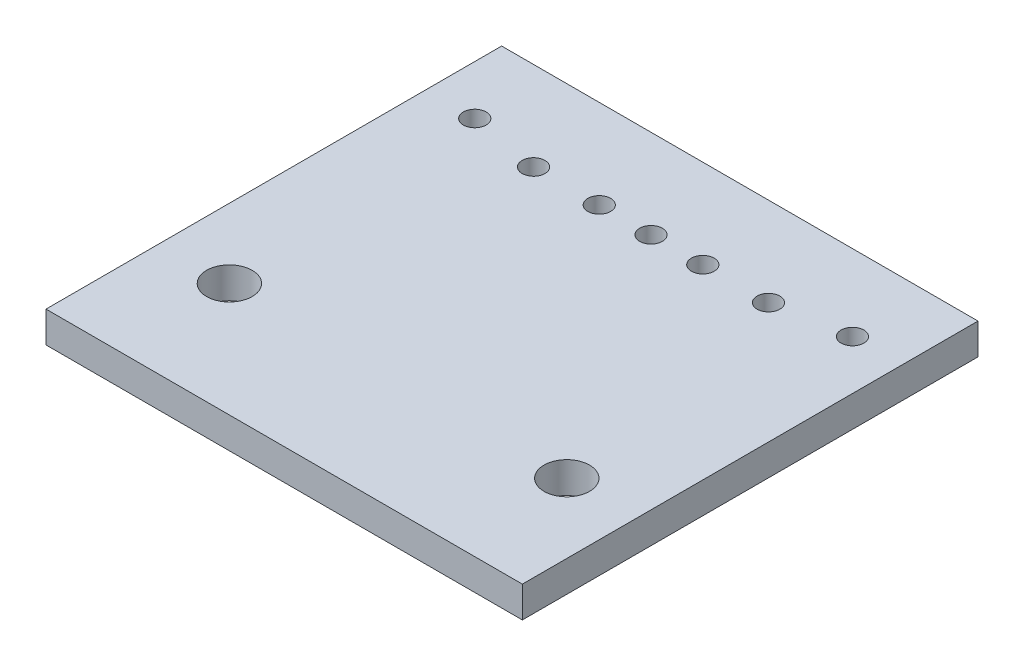
ISO-10303-21;
HEADER;
FILE_DESCRIPTION(('STEP AP214'),'2;1');
FILE_NAME('part.step','',(''),(''),'','','');
FILE_SCHEMA(('AUTOMOTIVE_DESIGN { 1 0 10303 214 1 1 1 1 }'));
ENDSEC;
DATA;
#1=APPLICATION_CONTEXT('core data for automotive mechanical design processes');
#2=APPLICATION_PROTOCOL_DEFINITION('international standard','automotive_design',2000,#1);
#3=PRODUCT_CONTEXT('',#1,'mechanical');
#4=PRODUCT('Part','Part','',(#3));
#5=PRODUCT_RELATED_PRODUCT_CATEGORY('part','',(#4));
#6=PRODUCT_DEFINITION_FORMATION('','',#4);
#7=PRODUCT_DEFINITION_CONTEXT('part definition',#1,'design');
#8=PRODUCT_DEFINITION('design','',#6,#7);
#9=PRODUCT_DEFINITION_SHAPE('','',#8);
#10=(LENGTH_UNIT() NAMED_UNIT(*) SI_UNIT(.MILLI.,.METRE.));
#11=(NAMED_UNIT(*) PLANE_ANGLE_UNIT() SI_UNIT($,.RADIAN.));
#12=(NAMED_UNIT(*) SI_UNIT($,.STERADIAN.) SOLID_ANGLE_UNIT());
#13=UNCERTAINTY_MEASURE_WITH_UNIT(LENGTH_MEASURE(1.E-05),#10,'distance_accuracy_value','');
#14=(GEOMETRIC_REPRESENTATION_CONTEXT(3) GLOBAL_UNCERTAINTY_ASSIGNED_CONTEXT((#13)) GLOBAL_UNIT_ASSIGNED_CONTEXT((#10,
#11,#12)) REPRESENTATION_CONTEXT('',''));
#15=CARTESIAN_POINT('',(0.,0.,0.));
#16=DIRECTION('',(0.,0.,1.));
#17=DIRECTION('',(1.,0.,0.));
#18=AXIS2_PLACEMENT_3D('',#15,#16,#17);
#19=CARTESIAN_POINT('',(11.5,1.5,11.));
#20=DIRECTION('',(-1.,0.,0.));
#21=DIRECTION('',(0.,0.,1.));
#22=AXIS2_PLACEMENT_3D('',#19,#20,#21);
#23=PLANE('',#22);
#24=DIRECTION('',(0.,0.,-1.));
#25=VECTOR('',#24,1.);
#26=CARTESIAN_POINT('',(11.5,0.,11.));
#27=LINE('',#26,#25);
#28=CARTESIAN_POINT('',(11.5,0.,11.));
#29=VERTEX_POINT('',#28);
#30=CARTESIAN_POINT('',(11.5,0.,-11.));
#31=VERTEX_POINT('',#30);
#32=EDGE_CURVE('E96',#29,#31,#27,.T.);
#33=ORIENTED_EDGE('',*,*,#32,.T.);
#34=DIRECTION('',(0.,-1.,0.));
#35=VECTOR('',#34,1.);
#36=CARTESIAN_POINT('',(11.5,1.5,-11.));
#37=LINE('',#36,#35);
#38=CARTESIAN_POINT('',(11.5,1.5,-11.));
#39=VERTEX_POINT('',#38);
#40=EDGE_CURVE('E11',#39,#31,#37,.T.);
#41=ORIENTED_EDGE('',*,*,#40,.F.);
#42=DIRECTION('',(0.,0.,-1.));
#43=VECTOR('',#42,1.);
#44=CARTESIAN_POINT('',(11.5,1.5,11.));
#45=LINE('',#44,#43);
#46=CARTESIAN_POINT('',(11.5,1.5,11.));
#47=VERTEX_POINT('',#46);
#48=EDGE_CURVE('E84',#47,#39,#45,.T.);
#49=ORIENTED_EDGE('',*,*,#48,.F.);
#50=DIRECTION('',(0.,-1.,0.));
#51=VECTOR('',#50,1.);
#52=CARTESIAN_POINT('',(11.5,1.5,11.));
#53=LINE('',#52,#51);
#54=EDGE_CURVE('E92',#47,#29,#53,.T.);
#55=ORIENTED_EDGE('',*,*,#54,.T.);
#56=EDGE_LOOP('',(#33,#41,#49,#55));
#57=FACE_BOUND('',#56,.T.);
#58=ADVANCED_FACE('F33',(#57),#23,.F.);
#59=CARTESIAN_POINT('',(-11.5,1.5,-11.));
#60=DIRECTION('',(0.,0.,1.));
#61=DIRECTION('',(1.,0.,0.));
#62=AXIS2_PLACEMENT_3D('',#59,#60,#61);
#63=PLANE('',#62);
#64=DIRECTION('',(-1.,0.,0.));
#65=VECTOR('',#64,1.);
#66=CARTESIAN_POINT('',(-11.5,0.,-11.));
#67=LINE('',#66,#65);
#68=CARTESIAN_POINT('',(-11.5,0.,-11.));
#69=VERTEX_POINT('',#68);
#70=EDGE_CURVE('E88',#31,#69,#67,.T.);
#71=ORIENTED_EDGE('',*,*,#70,.T.);
#72=DIRECTION('',(0.,-1.,0.));
#73=VECTOR('',#72,1.);
#74=CARTESIAN_POINT('',(-11.5,1.5,-11.));
#75=LINE('',#74,#73);
#76=CARTESIAN_POINT('',(-11.5,1.5,-11.));
#77=VERTEX_POINT('',#76);
#78=EDGE_CURVE('E41',#77,#69,#75,.T.);
#79=ORIENTED_EDGE('',*,*,#78,.F.);
#80=DIRECTION('',(-1.,0.,0.));
#81=VECTOR('',#80,1.);
#82=CARTESIAN_POINT('',(-11.5,1.5,-11.));
#83=LINE('',#82,#81);
#84=EDGE_CURVE('E79',#39,#77,#83,.T.);
#85=ORIENTED_EDGE('',*,*,#84,.F.);
#86=ORIENTED_EDGE('',*,*,#40,.T.);
#87=EDGE_LOOP('',(#71,#79,#85,#86));
#88=FACE_BOUND('',#87,.T.);
#89=ADVANCED_FACE('F87',(#88),#63,.F.);
#90=CARTESIAN_POINT('',(-11.5,1.5,11.));
#91=DIRECTION('',(1.,0.,0.));
#92=DIRECTION('',(0.,0.,-1.));
#93=AXIS2_PLACEMENT_3D('',#90,#91,#92);
#94=PLANE('',#93);
#95=DIRECTION('',(0.,0.,1.));
#96=VECTOR('',#95,1.);
#97=CARTESIAN_POINT('',(-11.5,0.,11.));
#98=LINE('',#97,#96);
#99=CARTESIAN_POINT('',(-11.5,0.,11.));
#100=VERTEX_POINT('',#99);
#101=EDGE_CURVE('E66',#69,#100,#98,.T.);
#102=ORIENTED_EDGE('',*,*,#101,.T.);
#103=DIRECTION('',(0.,-1.,0.));
#104=VECTOR('',#103,1.);
#105=CARTESIAN_POINT('',(-11.5,1.5,11.));
#106=LINE('',#105,#104);
#107=CARTESIAN_POINT('',(-11.5,1.5,11.));
#108=VERTEX_POINT('',#107);
#109=EDGE_CURVE('E89',#108,#100,#106,.T.);
#110=ORIENTED_EDGE('',*,*,#109,.F.);
#111=DIRECTION('',(0.,0.,1.));
#112=VECTOR('',#111,1.);
#113=CARTESIAN_POINT('',(-11.5,1.5,11.));
#114=LINE('',#113,#112);
#115=EDGE_CURVE('E82',#77,#108,#114,.T.);
#116=ORIENTED_EDGE('',*,*,#115,.F.);
#117=ORIENTED_EDGE('',*,*,#78,.T.);
#118=EDGE_LOOP('',(#102,#110,#116,#117));
#119=FACE_BOUND('',#118,.T.);
#120=ADVANCED_FACE('F90',(#119),#94,.F.);
#121=CARTESIAN_POINT('',(-11.5,1.5,11.));
#122=DIRECTION('',(0.,0.,-1.));
#123=DIRECTION('',(-1.,0.,0.));
#124=AXIS2_PLACEMENT_3D('',#121,#122,#123);
#125=PLANE('',#124);
#126=DIRECTION('',(1.,0.,0.));
#127=VECTOR('',#126,1.);
#128=CARTESIAN_POINT('',(-11.5,0.,11.));
#129=LINE('',#128,#127);
#130=EDGE_CURVE('E72',#100,#29,#129,.T.);
#131=ORIENTED_EDGE('',*,*,#130,.T.);
#132=ORIENTED_EDGE('',*,*,#54,.F.);
#133=DIRECTION('',(1.,0.,0.));
#134=VECTOR('',#133,1.);
#135=CARTESIAN_POINT('',(-11.5,1.5,11.));
#136=LINE('',#135,#134);
#137=EDGE_CURVE('E49',#108,#47,#136,.T.);
#138=ORIENTED_EDGE('',*,*,#137,.F.);
#139=ORIENTED_EDGE('',*,*,#109,.T.);
#140=EDGE_LOOP('',(#131,#132,#138,#139));
#141=FACE_BOUND('',#140,.T.);
#142=ADVANCED_FACE('F104',(#141),#125,.F.);
#143=CARTESIAN_POINT('',(0.,1.5,0.));
#144=DIRECTION('',(0.,-1.,0.));
#145=DIRECTION('',(0.,0.,-1.));
#146=AXIS2_PLACEMENT_3D('',#143,#144,#145);
#147=PLANE('',#146);
#148=CARTESIAN_POINT('',(8.1450664253096,1.5,5.5));
#149=DIRECTION('',(0.,1.,0.));
#150=DIRECTION('',(0.,0.,1.));
#151=AXIS2_PLACEMENT_3D('',#148,#149,#150);
#152=CIRCLE('',#151,1.1);
#153=CARTESIAN_POINT('',(8.1450664253096,1.5,6.6));
#154=VERTEX_POINT('',#153);
#155=EDGE_CURVE('E119',#154,#154,#152,.T.);
#156=ORIENTED_EDGE('',*,*,#155,.F.);
#157=EDGE_LOOP('',(#156));
#158=FACE_BOUND('',#157,.T.);
#159=CARTESIAN_POINT('',(9.11849204751855,1.5,-7.32020541675792));
#160=DIRECTION('',(0.,1.,0.));
#161=DIRECTION('',(0.,0.,1.));
#162=AXIS2_PLACEMENT_3D('',#159,#160,#161);
#163=CIRCLE('',#162,0.55);
#164=CARTESIAN_POINT('',(9.11849204751855,1.5,-6.77020541675792));
#165=VERTEX_POINT('',#164);
#166=EDGE_CURVE('E125',#165,#165,#163,.T.);
#167=ORIENTED_EDGE('',*,*,#166,.F.);
#168=EDGE_LOOP('',(#167));
#169=FACE_BOUND('',#168,.T.);
#170=CARTESIAN_POINT('',(5.67171117427743,1.5,-6.71217488322363));
#171=DIRECTION('',(0.,1.,0.));
#172=DIRECTION('',(0.,0.,1.));
#173=AXIS2_PLACEMENT_3D('',#170,#171,#172);
#174=CIRCLE('',#173,0.55);
#175=CARTESIAN_POINT('',(5.67171117427743,1.5,-6.16217488322363));
#176=VERTEX_POINT('',#175);
#177=EDGE_CURVE('E131',#176,#176,#174,.T.);
#178=ORIENTED_EDGE('',*,*,#177,.F.);
#179=EDGE_LOOP('',(#178));
#180=FACE_BOUND('',#179,.T.);
#181=CARTESIAN_POINT('',(2.50002915730698,1.5,-6.71226735777462));
#182=DIRECTION('',(0.,1.,0.));
#183=DIRECTION('',(0.,0.,1.));
#184=AXIS2_PLACEMENT_3D('',#181,#182,#183);
#185=CIRCLE('',#184,0.55);
#186=CARTESIAN_POINT('',(2.50002915730698,1.5,-6.16226735777462));
#187=VERTEX_POINT('',#186);
#188=EDGE_CURVE('E137',#187,#187,#185,.T.);
#189=ORIENTED_EDGE('',*,*,#188,.F.);
#190=EDGE_LOOP('',(#189));
#191=FACE_BOUND('',#190,.T.);
#192=CARTESIAN_POINT('',(2.91583695959975E-05,1.5,-6.71234024855502));
#193=DIRECTION('',(0.,1.,0.));
#194=DIRECTION('',(0.,0.,1.));
#195=AXIS2_PLACEMENT_3D('',#192,#193,#194);
#196=CIRCLE('',#195,0.55);
#197=CARTESIAN_POINT('',(2.91583695959975E-05,1.5,-6.16234024855502));
#198=VERTEX_POINT('',#197);
#199=EDGE_CURVE('E143',#198,#198,#196,.T.);
#200=ORIENTED_EDGE('',*,*,#199,.F.);
#201=EDGE_LOOP('',(#200));
#202=FACE_BOUND('',#201,.T.);
#203=CARTESIAN_POINT('',(-2.49997084056779,1.5,-6.71241313933541));
#204=DIRECTION('',(0.,1.,0.));
#205=DIRECTION('',(0.,0.,1.));
#206=AXIS2_PLACEMENT_3D('',#203,#204,#205);
#207=CIRCLE('',#206,0.55);
#208=CARTESIAN_POINT('',(-2.49997084056779,1.5,-6.16241313933541));
#209=VERTEX_POINT('',#208);
#210=EDGE_CURVE('E149',#209,#209,#207,.T.);
#211=ORIENTED_EDGE('',*,*,#210,.F.);
#212=EDGE_LOOP('',(#211));
#213=FACE_BOUND('',#212,.T.);
#214=CARTESIAN_POINT('',(-5.67165285753824,1.5,-6.7125056138864));
#215=DIRECTION('',(0.,1.,0.));
#216=DIRECTION('',(0.,0.,1.));
#217=AXIS2_PLACEMENT_3D('',#214,#215,#216);
#218=CIRCLE('',#217,0.55);
#219=CARTESIAN_POINT('',(-5.67165285753824,1.5,-6.1625056138864));
#220=VERTEX_POINT('',#219);
#221=EDGE_CURVE('E155',#220,#220,#218,.T.);
#222=ORIENTED_EDGE('',*,*,#221,.F.);
#223=EDGE_LOOP('',(#222));
#224=FACE_BOUND('',#223,.T.);
#225=CARTESIAN_POINT('',(-9.11847999308096,1.5,-7.32027423572068));
#226=DIRECTION('',(0.,1.,0.));
#227=DIRECTION('',(0.,0.,1.));
#228=AXIS2_PLACEMENT_3D('',#225,#226,#227);
#229=CIRCLE('',#228,0.55);
#230=CARTESIAN_POINT('',(-9.11847999308096,1.5,-6.77027423572068));
#231=VERTEX_POINT('',#230);
#232=EDGE_CURVE('E113',#231,#231,#229,.T.);
#233=ORIENTED_EDGE('',*,*,#232,.F.);
#234=EDGE_LOOP('',(#233));
#235=FACE_BOUND('',#234,.T.);
#236=CARTESIAN_POINT('',(-8.1450664253096,1.5,5.5));
#237=DIRECTION('',(0.,1.,0.));
#238=DIRECTION('',(0.,0.,1.));
#239=AXIS2_PLACEMENT_3D('',#236,#237,#238);
#240=CIRCLE('',#239,1.1);
#241=CARTESIAN_POINT('',(-8.1450664253096,1.5,6.6));
#242=VERTEX_POINT('',#241);
#243=EDGE_CURVE('E110',#242,#242,#240,.T.);
#244=ORIENTED_EDGE('',*,*,#243,.F.);
#245=EDGE_LOOP('',(#244));
#246=FACE_BOUND('',#245,.T.);
#247=ORIENTED_EDGE('',*,*,#48,.T.);
#248=ORIENTED_EDGE('',*,*,#84,.T.);
#249=ORIENTED_EDGE('',*,*,#115,.T.);
#250=ORIENTED_EDGE('',*,*,#137,.T.);
#251=EDGE_LOOP('',(#247,#248,#249,#250));
#252=FACE_BOUND('',#251,.T.);
#253=ADVANCED_FACE('F80',(#158,#169,#180,#191,#202,#213,#224,#235,#246,#252),#147,.F.);
#254=CARTESIAN_POINT('',(0.,0.,0.));
#255=DIRECTION('',(0.,-1.,0.));
#256=DIRECTION('',(0.,0.,-1.));
#257=AXIS2_PLACEMENT_3D('',#254,#255,#256);
#258=PLANE('',#257);
#259=CARTESIAN_POINT('',(8.1450664253096,0.,5.5));
#260=DIRECTION('',(0.,1.,0.));
#261=DIRECTION('',(0.,0.,1.));
#262=AXIS2_PLACEMENT_3D('',#259,#260,#261);
#263=CIRCLE('',#262,1.1);
#264=CARTESIAN_POINT('',(8.1450664253096,0.,6.6));
#265=VERTEX_POINT('',#264);
#266=EDGE_CURVE('E116',#265,#265,#263,.T.);
#267=ORIENTED_EDGE('',*,*,#266,.T.);
#268=EDGE_LOOP('',(#267));
#269=FACE_BOUND('',#268,.T.);
#270=CARTESIAN_POINT('',(9.11849204751855,0.,-7.32020541675792));
#271=DIRECTION('',(0.,1.,0.));
#272=DIRECTION('',(0.,0.,1.));
#273=AXIS2_PLACEMENT_3D('',#270,#271,#272);
#274=CIRCLE('',#273,0.55);
#275=CARTESIAN_POINT('',(9.11849204751855,0.,-6.77020541675792));
#276=VERTEX_POINT('',#275);
#277=EDGE_CURVE('E122',#276,#276,#274,.T.);
#278=ORIENTED_EDGE('',*,*,#277,.T.);
#279=EDGE_LOOP('',(#278));
#280=FACE_BOUND('',#279,.T.);
#281=CARTESIAN_POINT('',(5.67171117427743,0.,-6.71217488322363));
#282=DIRECTION('',(0.,1.,0.));
#283=DIRECTION('',(0.,0.,1.));
#284=AXIS2_PLACEMENT_3D('',#281,#282,#283);
#285=CIRCLE('',#284,0.55);
#286=CARTESIAN_POINT('',(5.67171117427743,0.,-6.16217488322363));
#287=VERTEX_POINT('',#286);
#288=EDGE_CURVE('E128',#287,#287,#285,.T.);
#289=ORIENTED_EDGE('',*,*,#288,.T.);
#290=EDGE_LOOP('',(#289));
#291=FACE_BOUND('',#290,.T.);
#292=CARTESIAN_POINT('',(2.50002915730698,0.,-6.71226735777462));
#293=DIRECTION('',(0.,1.,0.));
#294=DIRECTION('',(0.,0.,1.));
#295=AXIS2_PLACEMENT_3D('',#292,#293,#294);
#296=CIRCLE('',#295,0.55);
#297=CARTESIAN_POINT('',(2.50002915730698,0.,-6.16226735777462));
#298=VERTEX_POINT('',#297);
#299=EDGE_CURVE('E134',#298,#298,#296,.T.);
#300=ORIENTED_EDGE('',*,*,#299,.T.);
#301=EDGE_LOOP('',(#300));
#302=FACE_BOUND('',#301,.T.);
#303=CARTESIAN_POINT('',(2.91583695959975E-05,0.,-6.71234024855502));
#304=DIRECTION('',(0.,1.,0.));
#305=DIRECTION('',(0.,0.,1.));
#306=AXIS2_PLACEMENT_3D('',#303,#304,#305);
#307=CIRCLE('',#306,0.55);
#308=CARTESIAN_POINT('',(2.91583695959975E-05,0.,-6.16234024855502));
#309=VERTEX_POINT('',#308);
#310=EDGE_CURVE('E140',#309,#309,#307,.T.);
#311=ORIENTED_EDGE('',*,*,#310,.T.);
#312=EDGE_LOOP('',(#311));
#313=FACE_BOUND('',#312,.T.);
#314=CARTESIAN_POINT('',(-2.49997084056779,0.,-6.71241313933541));
#315=DIRECTION('',(0.,1.,0.));
#316=DIRECTION('',(0.,0.,1.));
#317=AXIS2_PLACEMENT_3D('',#314,#315,#316);
#318=CIRCLE('',#317,0.55);
#319=CARTESIAN_POINT('',(-2.49997084056779,0.,-6.16241313933541));
#320=VERTEX_POINT('',#319);
#321=EDGE_CURVE('E146',#320,#320,#318,.T.);
#322=ORIENTED_EDGE('',*,*,#321,.T.);
#323=EDGE_LOOP('',(#322));
#324=FACE_BOUND('',#323,.T.);
#325=CARTESIAN_POINT('',(-5.67165285753824,0.,-6.7125056138864));
#326=DIRECTION('',(0.,1.,0.));
#327=DIRECTION('',(0.,0.,1.));
#328=AXIS2_PLACEMENT_3D('',#325,#326,#327);
#329=CIRCLE('',#328,0.55);
#330=CARTESIAN_POINT('',(-5.67165285753824,0.,-6.1625056138864));
#331=VERTEX_POINT('',#330);
#332=EDGE_CURVE('E152',#331,#331,#329,.T.);
#333=ORIENTED_EDGE('',*,*,#332,.T.);
#334=EDGE_LOOP('',(#333));
#335=FACE_BOUND('',#334,.T.);
#336=CARTESIAN_POINT('',(-9.11847999308096,0.,-7.32027423572068));
#337=DIRECTION('',(0.,1.,0.));
#338=DIRECTION('',(0.,0.,1.));
#339=AXIS2_PLACEMENT_3D('',#336,#337,#338);
#340=CIRCLE('',#339,0.55);
#341=CARTESIAN_POINT('',(-9.11847999308096,0.,-6.77027423572068));
#342=VERTEX_POINT('',#341);
#343=EDGE_CURVE('E158',#342,#342,#340,.T.);
#344=ORIENTED_EDGE('',*,*,#343,.T.);
#345=EDGE_LOOP('',(#344));
#346=FACE_BOUND('',#345,.T.);
#347=CARTESIAN_POINT('',(-8.1450664253096,0.,5.5));
#348=DIRECTION('',(0.,1.,0.));
#349=DIRECTION('',(0.,0.,1.));
#350=AXIS2_PLACEMENT_3D('',#347,#348,#349);
#351=CIRCLE('',#350,1.1);
#352=CARTESIAN_POINT('',(-8.1450664253096,0.,6.6));
#353=VERTEX_POINT('',#352);
#354=EDGE_CURVE('E99',#353,#353,#351,.T.);
#355=ORIENTED_EDGE('',*,*,#354,.T.);
#356=EDGE_LOOP('',(#355));
#357=FACE_BOUND('',#356,.T.);
#358=ORIENTED_EDGE('',*,*,#32,.F.);
#359=ORIENTED_EDGE('',*,*,#130,.F.);
#360=ORIENTED_EDGE('',*,*,#101,.F.);
#361=ORIENTED_EDGE('',*,*,#70,.F.);
#362=EDGE_LOOP('',(#358,#359,#360,#361));
#363=FACE_BOUND('',#362,.T.);
#364=ADVANCED_FACE('F107',(#269,#280,#291,#302,#313,#324,#335,#346,#357,#363),#258,.T.);
#365=CARTESIAN_POINT('',(-8.1450664253096,0.,5.5));
#366=DIRECTION('',(0.,1.,0.));
#367=DIRECTION('',(0.,0.,1.));
#368=AXIS2_PLACEMENT_3D('',#365,#366,#367);
#369=CYLINDRICAL_SURFACE('',#368,1.1);
#370=ORIENTED_EDGE('',*,*,#354,.F.);
#371=EDGE_LOOP('',(#370));
#372=FACE_BOUND('',#371,.T.);
#373=ORIENTED_EDGE('',*,*,#243,.T.);
#374=EDGE_LOOP('',(#373));
#375=FACE_BOUND('',#374,.T.);
#376=ADVANCED_FACE('F172',(#372,#375),#369,.F.);
#377=CARTESIAN_POINT('',(-9.11847999308096,0.,-7.32027423572068));
#378=DIRECTION('',(0.,1.,0.));
#379=DIRECTION('',(0.,0.,1.));
#380=AXIS2_PLACEMENT_3D('',#377,#378,#379);
#381=CYLINDRICAL_SURFACE('',#380,0.55);
#382=ORIENTED_EDGE('',*,*,#343,.F.);
#383=EDGE_LOOP('',(#382));
#384=FACE_BOUND('',#383,.T.);
#385=ORIENTED_EDGE('',*,*,#232,.T.);
#386=EDGE_LOOP('',(#385));
#387=FACE_BOUND('',#386,.T.);
#388=ADVANCED_FACE('F164',(#384,#387),#381,.F.);
#389=CARTESIAN_POINT('',(-5.67165285753824,0.,-6.7125056138864));
#390=DIRECTION('',(0.,1.,0.));
#391=DIRECTION('',(0.,0.,1.));
#392=AXIS2_PLACEMENT_3D('',#389,#390,#391);
#393=CYLINDRICAL_SURFACE('',#392,0.55);
#394=ORIENTED_EDGE('',*,*,#332,.F.);
#395=EDGE_LOOP('',(#394));
#396=FACE_BOUND('',#395,.T.);
#397=ORIENTED_EDGE('',*,*,#221,.T.);
#398=EDGE_LOOP('',(#397));
#399=FACE_BOUND('',#398,.T.);
#400=ADVANCED_FACE('F180',(#396,#399),#393,.F.);
#401=CARTESIAN_POINT('',(-2.49997084056779,0.,-6.71241313933541));
#402=DIRECTION('',(0.,1.,0.));
#403=DIRECTION('',(0.,0.,1.));
#404=AXIS2_PLACEMENT_3D('',#401,#402,#403);
#405=CYLINDRICAL_SURFACE('',#404,0.55);
#406=ORIENTED_EDGE('',*,*,#321,.F.);
#407=EDGE_LOOP('',(#406));
#408=FACE_BOUND('',#407,.T.);
#409=ORIENTED_EDGE('',*,*,#210,.T.);
#410=EDGE_LOOP('',(#409));
#411=FACE_BOUND('',#410,.T.);
#412=ADVANCED_FACE('F228',(#408,#411),#405,.F.);
#413=CARTESIAN_POINT('',(2.91583695959975E-05,0.,-6.71234024855502));
#414=DIRECTION('',(0.,1.,0.));
#415=DIRECTION('',(0.,0.,1.));
#416=AXIS2_PLACEMENT_3D('',#413,#414,#415);
#417=CYLINDRICAL_SURFACE('',#416,0.55);
#418=ORIENTED_EDGE('',*,*,#310,.F.);
#419=EDGE_LOOP('',(#418));
#420=FACE_BOUND('',#419,.T.);
#421=ORIENTED_EDGE('',*,*,#199,.T.);
#422=EDGE_LOOP('',(#421));
#423=FACE_BOUND('',#422,.T.);
#424=ADVANCED_FACE('F238',(#420,#423),#417,.F.);
#425=CARTESIAN_POINT('',(2.50002915730698,0.,-6.71226735777462));
#426=DIRECTION('',(0.,1.,0.));
#427=DIRECTION('',(0.,0.,1.));
#428=AXIS2_PLACEMENT_3D('',#425,#426,#427);
#429=CYLINDRICAL_SURFACE('',#428,0.55);
#430=ORIENTED_EDGE('',*,*,#299,.F.);
#431=EDGE_LOOP('',(#430));
#432=FACE_BOUND('',#431,.T.);
#433=ORIENTED_EDGE('',*,*,#188,.T.);
#434=EDGE_LOOP('',(#433));
#435=FACE_BOUND('',#434,.T.);
#436=ADVANCED_FACE('F248',(#432,#435),#429,.F.);
#437=CARTESIAN_POINT('',(5.67171117427743,0.,-6.71217488322363));
#438=DIRECTION('',(0.,1.,0.));
#439=DIRECTION('',(0.,0.,1.));
#440=AXIS2_PLACEMENT_3D('',#437,#438,#439);
#441=CYLINDRICAL_SURFACE('',#440,0.55);
#442=ORIENTED_EDGE('',*,*,#288,.F.);
#443=EDGE_LOOP('',(#442));
#444=FACE_BOUND('',#443,.T.);
#445=ORIENTED_EDGE('',*,*,#177,.T.);
#446=EDGE_LOOP('',(#445));
#447=FACE_BOUND('',#446,.T.);
#448=ADVANCED_FACE('F258',(#444,#447),#441,.F.);
#449=CARTESIAN_POINT('',(9.11849204751855,0.,-7.32020541675792));
#450=DIRECTION('',(0.,1.,0.));
#451=DIRECTION('',(0.,0.,1.));
#452=AXIS2_PLACEMENT_3D('',#449,#450,#451);
#453=CYLINDRICAL_SURFACE('',#452,0.55);
#454=ORIENTED_EDGE('',*,*,#277,.F.);
#455=EDGE_LOOP('',(#454));
#456=FACE_BOUND('',#455,.T.);
#457=ORIENTED_EDGE('',*,*,#166,.T.);
#458=EDGE_LOOP('',(#457));
#459=FACE_BOUND('',#458,.T.);
#460=ADVANCED_FACE('F268',(#456,#459),#453,.F.);
#461=CARTESIAN_POINT('',(8.1450664253096,0.,5.5));
#462=DIRECTION('',(0.,1.,0.));
#463=DIRECTION('',(0.,0.,1.));
#464=AXIS2_PLACEMENT_3D('',#461,#462,#463);
#465=CYLINDRICAL_SURFACE('',#464,1.1);
#466=ORIENTED_EDGE('',*,*,#266,.F.);
#467=EDGE_LOOP('',(#466));
#468=FACE_BOUND('',#467,.T.);
#469=ORIENTED_EDGE('',*,*,#155,.T.);
#470=EDGE_LOOP('',(#469));
#471=FACE_BOUND('',#470,.T.);
#472=ADVANCED_FACE('F278',(#468,#471),#465,.F.);
#473=CLOSED_SHELL('',(#58,#89,#120,#142,#253,#364,#376,#388,#400,#412,#424,#436,#448,#460,#472));
#474=MANIFOLD_SOLID_BREP('B2',#473);
#475=ADVANCED_BREP_SHAPE_REPRESENTATION('',(#18,#474),#14);
#476=SHAPE_DEFINITION_REPRESENTATION(#9,#475);
ENDSEC;
END-ISO-10303-21;
